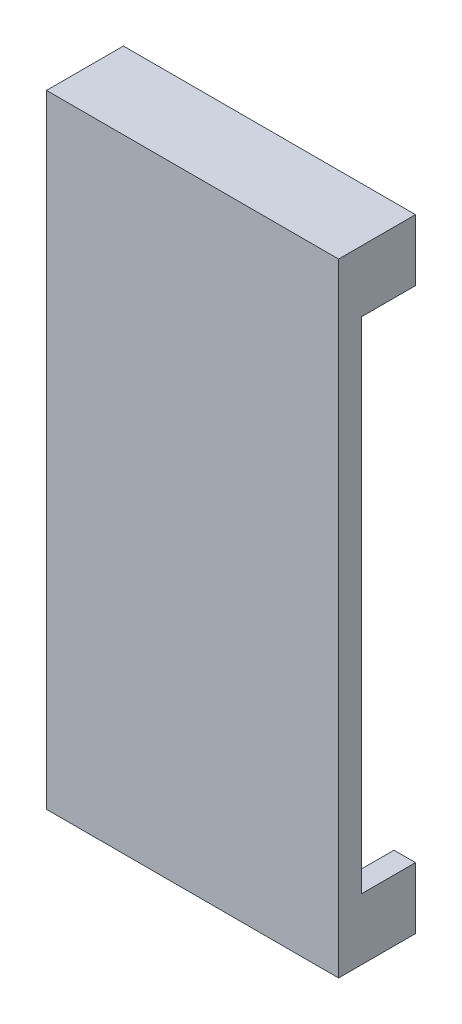
ISO-10303-21;
HEADER;
FILE_DESCRIPTION(('STEP AP214'),'2;1');
FILE_NAME('part.step','',(''),(''),'','','');
FILE_SCHEMA(('AUTOMOTIVE_DESIGN { 1 0 10303 214 1 1 1 1 }'));
ENDSEC;
DATA;
#1=APPLICATION_CONTEXT('core data for automotive mechanical design processes');
#2=APPLICATION_PROTOCOL_DEFINITION('international standard','automotive_design',2000,#1);
#3=PRODUCT_CONTEXT('',#1,'mechanical');
#4=PRODUCT('Part','Part','',(#3));
#5=PRODUCT_RELATED_PRODUCT_CATEGORY('part','',(#4));
#6=PRODUCT_DEFINITION_FORMATION('','',#4);
#7=PRODUCT_DEFINITION_CONTEXT('part definition',#1,'design');
#8=PRODUCT_DEFINITION('design','',#6,#7);
#9=PRODUCT_DEFINITION_SHAPE('','',#8);
#10=(LENGTH_UNIT() NAMED_UNIT(*) SI_UNIT(.MILLI.,.METRE.));
#11=(NAMED_UNIT(*) PLANE_ANGLE_UNIT() SI_UNIT($,.RADIAN.));
#12=(NAMED_UNIT(*) SI_UNIT($,.STERADIAN.) SOLID_ANGLE_UNIT());
#13=UNCERTAINTY_MEASURE_WITH_UNIT(LENGTH_MEASURE(1.E-05),#10,'distance_accuracy_value','');
#14=(GEOMETRIC_REPRESENTATION_CONTEXT(3) GLOBAL_UNCERTAINTY_ASSIGNED_CONTEXT((#13)) GLOBAL_UNIT_ASSIGNED_CONTEXT((#10,
#11,#12)) REPRESENTATION_CONTEXT('',''));
#15=CARTESIAN_POINT('',(0.,0.,0.));
#16=DIRECTION('',(0.,0.,1.));
#17=DIRECTION('',(1.,0.,0.));
#18=AXIS2_PLACEMENT_3D('',#15,#16,#17);
#19=CARTESIAN_POINT('',(0.,0.,0.));
#20=DIRECTION('',(0.,0.,1.));
#21=DIRECTION('',(1.,0.,0.));
#22=AXIS2_PLACEMENT_3D('',#19,#20,#21);
#23=PLANE('',#22);
#24=DIRECTION('',(1.,0.,0.));
#25=VECTOR('',#24,1.);
#26=CARTESIAN_POINT('',(19.,-70.5,0.));
#27=LINE('',#26,#25);
#28=CARTESIAN_POINT('',(16.2,-70.5,0.));
#29=VERTEX_POINT('',#28);
#30=CARTESIAN_POINT('',(19.,-70.5,0.));
#31=VERTEX_POINT('',#30);
#32=EDGE_CURVE('E286',#29,#31,#27,.T.);
#33=ORIENTED_EDGE('',*,*,#32,.F.);
#34=DIRECTION('',(0.,1.,0.));
#35=VECTOR('',#34,1.);
#36=CARTESIAN_POINT('',(16.2,-70.5,0.));
#37=LINE('',#36,#35);
#38=CARTESIAN_POINT('',(16.2,-77.1999999999999,0.));
#39=VERTEX_POINT('',#38);
#40=EDGE_CURVE('E168',#39,#29,#37,.T.);
#41=ORIENTED_EDGE('',*,*,#40,.F.);
#42=DIRECTION('',(1.,0.,0.));
#43=VECTOR('',#42,1.);
#44=CARTESIAN_POINT('',(16.2,-77.1999999999999,0.));
#45=LINE('',#44,#43);
#46=CARTESIAN_POINT('',(-16.2,-77.1999999999999,0.));
#47=VERTEX_POINT('',#46);
#48=EDGE_CURVE('E164',#47,#39,#45,.T.);
#49=ORIENTED_EDGE('',*,*,#48,.F.);
#50=DIRECTION('',(0.,-1.,0.));
#51=VECTOR('',#50,1.);
#52=CARTESIAN_POINT('',(-16.2,-70.5,0.));
#53=LINE('',#52,#51);
#54=CARTESIAN_POINT('',(-16.2,-70.5,0.));
#55=VERTEX_POINT('',#54);
#56=EDGE_CURVE('E282',#55,#47,#53,.T.);
#57=ORIENTED_EDGE('',*,*,#56,.F.);
#58=DIRECTION('',(1.,0.,0.));
#59=VECTOR('',#58,1.);
#60=CARTESIAN_POINT('',(-19.,-70.5,0.));
#61=LINE('',#60,#59);
#62=CARTESIAN_POINT('',(-19.,-70.5,0.));
#63=VERTEX_POINT('',#62);
#64=EDGE_CURVE('E280',#63,#55,#61,.T.);
#65=ORIENTED_EDGE('',*,*,#64,.F.);
#66=DIRECTION('',(0.,-1.,0.));
#67=VECTOR('',#66,1.);
#68=CARTESIAN_POINT('',(-19.,-78.5,0.));
#69=LINE('',#68,#67);
#70=CARTESIAN_POINT('',(-19.,-5.49999999999998,0.));
#71=VERTEX_POINT('',#70);
#72=EDGE_CURVE('E227',#71,#63,#69,.T.);
#73=ORIENTED_EDGE('',*,*,#72,.F.);
#74=DIRECTION('',(-1.,0.,0.));
#75=VECTOR('',#74,1.);
#76=CARTESIAN_POINT('',(-19.,-5.49999999999997,0.));
#77=LINE('',#76,#75);
#78=CARTESIAN_POINT('',(-16.2,-5.49999999999997,0.));
#79=VERTEX_POINT('',#78);
#80=EDGE_CURVE('E49',#79,#71,#77,.T.);
#81=ORIENTED_EDGE('',*,*,#80,.F.);
#82=DIRECTION('',(0.,-1.,0.));
#83=VECTOR('',#82,1.);
#84=CARTESIAN_POINT('',(-16.2,-5.49999999999997,0.));
#85=LINE('',#84,#83);
#86=CARTESIAN_POINT('',(-16.2,1.2,0.));
#87=VERTEX_POINT('',#86);
#88=EDGE_CURVE('E53',#87,#79,#85,.T.);
#89=ORIENTED_EDGE('',*,*,#88,.F.);
#90=DIRECTION('',(-1.,0.,0.));
#91=VECTOR('',#90,1.);
#92=CARTESIAN_POINT('',(16.2,1.2,0.));
#93=LINE('',#92,#91);
#94=CARTESIAN_POINT('',(16.2,1.2,0.));
#95=VERTEX_POINT('',#94);
#96=EDGE_CURVE('E201',#95,#87,#93,.T.);
#97=ORIENTED_EDGE('',*,*,#96,.F.);
#98=DIRECTION('',(0.,1.,0.));
#99=VECTOR('',#98,1.);
#100=CARTESIAN_POINT('',(16.2,-5.49999999999997,0.));
#101=LINE('',#100,#99);
#102=CARTESIAN_POINT('',(16.2,-5.49999999999997,0.));
#103=VERTEX_POINT('',#102);
#104=EDGE_CURVE('E173',#103,#95,#101,.T.);
#105=ORIENTED_EDGE('',*,*,#104,.F.);
#106=DIRECTION('',(-1.,0.,0.));
#107=VECTOR('',#106,1.);
#108=CARTESIAN_POINT('',(19.,-5.49999999999997,0.));
#109=LINE('',#108,#107);
#110=CARTESIAN_POINT('',(19.,-5.49999999999998,0.));
#111=VERTEX_POINT('',#110);
#112=EDGE_CURVE('E170',#111,#103,#109,.T.);
#113=ORIENTED_EDGE('',*,*,#112,.F.);
#114=DIRECTION('',(0.,1.,0.));
#115=VECTOR('',#114,1.);
#116=CARTESIAN_POINT('',(19.,-78.5,0.));
#117=LINE('',#116,#115);
#118=EDGE_CURVE('E222',#31,#111,#117,.T.);
#119=ORIENTED_EDGE('',*,*,#118,.F.);
#120=EDGE_LOOP('',(#33,#41,#49,#57,#65,#73,#81,#89,#97,#105,#113,#119));
#121=FACE_BOUND('',#120,.T.);
#122=ADVANCED_FACE('F34',(#121),#23,.F.);
#123=CARTESIAN_POINT('',(19.,-78.5,3.));
#124=DIRECTION('',(-1.,0.,0.));
#125=DIRECTION('',(0.,-1.,0.));
#126=AXIS2_PLACEMENT_3D('',#123,#124,#125);
#127=PLANE('',#126);
#128=DIRECTION('',(0.,0.,-1.));
#129=VECTOR('',#128,1.);
#130=CARTESIAN_POINT('',(19.,-78.5,3.));
#131=LINE('',#130,#129);
#132=CARTESIAN_POINT('',(19.,-78.5,3.));
#133=VERTEX_POINT('',#132);
#134=CARTESIAN_POINT('',(19.,-78.5,-7.));
#135=VERTEX_POINT('',#134);
#136=EDGE_CURVE('E233',#133,#135,#131,.T.);
#137=ORIENTED_EDGE('',*,*,#136,.T.);
#138=DIRECTION('',(0.,-1.,0.));
#139=VECTOR('',#138,1.);
#140=CARTESIAN_POINT('',(19.,-70.5,-7.));
#141=LINE('',#140,#139);
#142=CARTESIAN_POINT('',(19.,-70.5,-7.));
#143=VERTEX_POINT('',#142);
#144=EDGE_CURVE('E154',#143,#135,#141,.T.);
#145=ORIENTED_EDGE('',*,*,#144,.F.);
#146=DIRECTION('',(0.,0.,1.));
#147=VECTOR('',#146,1.);
#148=CARTESIAN_POINT('',(19.,-70.5,-7.));
#149=LINE('',#148,#147);
#150=EDGE_CURVE('E150',#143,#31,#149,.T.);
#151=ORIENTED_EDGE('',*,*,#150,.T.);
#152=ORIENTED_EDGE('',*,*,#118,.T.);
#153=DIRECTION('',(0.,0.,1.));
#154=VECTOR('',#153,1.);
#155=CARTESIAN_POINT('',(19.,-5.49999999999997,-7.));
#156=LINE('',#155,#154);
#157=CARTESIAN_POINT('',(19.,-5.49999999999997,-7.));
#158=VERTEX_POINT('',#157);
#159=EDGE_CURVE('E197',#158,#111,#156,.T.);
#160=ORIENTED_EDGE('',*,*,#159,.F.);
#161=DIRECTION('',(0.,-1.,0.));
#162=VECTOR('',#161,1.);
#163=CARTESIAN_POINT('',(19.,-5.49999999999997,-7.));
#164=LINE('',#163,#162);
#165=CARTESIAN_POINT('',(19.,2.50000000000003,-7.));
#166=VERTEX_POINT('',#165);
#167=EDGE_CURVE('E196',#166,#158,#164,.T.);
#168=ORIENTED_EDGE('',*,*,#167,.F.);
#169=DIRECTION('',(0.,0.,-1.));
#170=VECTOR('',#169,1.);
#171=CARTESIAN_POINT('',(19.,2.50000000000003,3.));
#172=LINE('',#171,#170);
#173=CARTESIAN_POINT('',(19.,2.50000000000003,3.));
#174=VERTEX_POINT('',#173);
#175=EDGE_CURVE('E11',#174,#166,#172,.T.);
#176=ORIENTED_EDGE('',*,*,#175,.F.);
#177=DIRECTION('',(0.,1.,0.));
#178=VECTOR('',#177,1.);
#179=CARTESIAN_POINT('',(19.,-78.5,3.));
#180=LINE('',#179,#178);
#181=EDGE_CURVE('E223',#133,#174,#180,.T.);
#182=ORIENTED_EDGE('',*,*,#181,.F.);
#183=EDGE_LOOP('',(#137,#145,#151,#152,#160,#168,#176,#182));
#184=FACE_BOUND('',#183,.T.);
#185=ADVANCED_FACE('F36',(#184),#127,.F.);
#186=CARTESIAN_POINT('',(19.,2.50000000000003,3.));
#187=DIRECTION('',(0.,-1.,0.));
#188=DIRECTION('',(1.,0.,0.));
#189=AXIS2_PLACEMENT_3D('',#186,#187,#188);
#190=PLANE('',#189);
#191=ORIENTED_EDGE('',*,*,#175,.T.);
#192=DIRECTION('',(1.,0.,0.));
#193=VECTOR('',#192,1.);
#194=CARTESIAN_POINT('',(19.,2.50000000000003,-7.));
#195=LINE('',#194,#193);
#196=CARTESIAN_POINT('',(-19.,2.50000000000002,-7.));
#197=VERTEX_POINT('',#196);
#198=EDGE_CURVE('E193',#197,#166,#195,.T.);
#199=ORIENTED_EDGE('',*,*,#198,.F.);
#200=DIRECTION('',(0.,0.,-1.));
#201=VECTOR('',#200,1.);
#202=CARTESIAN_POINT('',(-19.,2.50000000000002,3.));
#203=LINE('',#202,#201);
#204=CARTESIAN_POINT('',(-19.,2.50000000000002,3.));
#205=VERTEX_POINT('',#204);
#206=EDGE_CURVE('E42',#205,#197,#203,.T.);
#207=ORIENTED_EDGE('',*,*,#206,.F.);
#208=DIRECTION('',(-1.,0.,0.));
#209=VECTOR('',#208,1.);
#210=CARTESIAN_POINT('',(19.,2.50000000000003,3.));
#211=LINE('',#210,#209);
#212=EDGE_CURVE('E226',#174,#205,#211,.T.);
#213=ORIENTED_EDGE('',*,*,#212,.F.);
#214=EDGE_LOOP('',(#191,#199,#207,#213));
#215=FACE_BOUND('',#214,.T.);
#216=ADVANCED_FACE('F252',(#215),#190,.F.);
#217=CARTESIAN_POINT('',(-19.,-78.5,3.));
#218=DIRECTION('',(1.,0.,0.));
#219=DIRECTION('',(0.,1.,0.));
#220=AXIS2_PLACEMENT_3D('',#217,#218,#219);
#221=PLANE('',#220);
#222=ORIENTED_EDGE('',*,*,#206,.T.);
#223=DIRECTION('',(0.,1.,0.));
#224=VECTOR('',#223,1.);
#225=CARTESIAN_POINT('',(-19.,2.50000000000002,-7.));
#226=LINE('',#225,#224);
#227=CARTESIAN_POINT('',(-19.,-5.49999999999997,-7.));
#228=VERTEX_POINT('',#227);
#229=EDGE_CURVE('E190',#228,#197,#226,.T.);
#230=ORIENTED_EDGE('',*,*,#229,.F.);
#231=DIRECTION('',(0.,0.,1.));
#232=VECTOR('',#231,1.);
#233=CARTESIAN_POINT('',(-19.,-5.49999999999997,-7.));
#234=LINE('',#233,#232);
#235=EDGE_CURVE('E207',#228,#71,#234,.T.);
#236=ORIENTED_EDGE('',*,*,#235,.T.);
#237=ORIENTED_EDGE('',*,*,#72,.T.);
#238=DIRECTION('',(0.,0.,1.));
#239=VECTOR('',#238,1.);
#240=CARTESIAN_POINT('',(-19.,-70.5,-7.));
#241=LINE('',#240,#239);
#242=CARTESIAN_POINT('',(-19.,-70.5,-7.));
#243=VERTEX_POINT('',#242);
#244=EDGE_CURVE('E175',#243,#63,#241,.T.);
#245=ORIENTED_EDGE('',*,*,#244,.F.);
#246=DIRECTION('',(0.,1.,0.));
#247=VECTOR('',#246,1.);
#248=CARTESIAN_POINT('',(-19.,-78.5,-7.));
#249=LINE('',#248,#247);
#250=CARTESIAN_POINT('',(-19.,-78.5,-7.));
#251=VERTEX_POINT('',#250);
#252=EDGE_CURVE('E303',#251,#243,#249,.T.);
#253=ORIENTED_EDGE('',*,*,#252,.F.);
#254=DIRECTION('',(0.,0.,-1.));
#255=VECTOR('',#254,1.);
#256=CARTESIAN_POINT('',(-19.,-78.5,3.));
#257=LINE('',#256,#255);
#258=CARTESIAN_POINT('',(-19.,-78.5,3.));
#259=VERTEX_POINT('',#258);
#260=EDGE_CURVE('E238',#259,#251,#257,.T.);
#261=ORIENTED_EDGE('',*,*,#260,.F.);
#262=DIRECTION('',(0.,-1.,0.));
#263=VECTOR('',#262,1.);
#264=CARTESIAN_POINT('',(-19.,-78.5,3.));
#265=LINE('',#264,#263);
#266=EDGE_CURVE('E229',#205,#259,#265,.T.);
#267=ORIENTED_EDGE('',*,*,#266,.F.);
#268=EDGE_LOOP('',(#222,#230,#236,#237,#245,#253,#261,#267));
#269=FACE_BOUND('',#268,.T.);
#270=ADVANCED_FACE('F243',(#269),#221,.F.);
#271=CARTESIAN_POINT('',(19.,-78.5,3.));
#272=DIRECTION('',(0.,1.,0.));
#273=DIRECTION('',(0.,0.,1.));
#274=AXIS2_PLACEMENT_3D('',#271,#272,#273);
#275=PLANE('',#274);
#276=ORIENTED_EDGE('',*,*,#260,.T.);
#277=DIRECTION('',(-1.,0.,0.));
#278=VECTOR('',#277,1.);
#279=CARTESIAN_POINT('',(19.,-78.5,-7.));
#280=LINE('',#279,#278);
#281=EDGE_CURVE('E306',#135,#251,#280,.T.);
#282=ORIENTED_EDGE('',*,*,#281,.F.);
#283=ORIENTED_EDGE('',*,*,#136,.F.);
#284=DIRECTION('',(1.,0.,0.));
#285=VECTOR('',#284,1.);
#286=CARTESIAN_POINT('',(19.,-78.5,3.));
#287=LINE('',#286,#285);
#288=EDGE_CURVE('E231',#259,#133,#287,.T.);
#289=ORIENTED_EDGE('',*,*,#288,.F.);
#290=EDGE_LOOP('',(#276,#282,#283,#289));
#291=FACE_BOUND('',#290,.T.);
#292=ADVANCED_FACE('F315',(#291),#275,.F.);
#293=CARTESIAN_POINT('',(0.,0.,3.));
#294=DIRECTION('',(0.,0.,1.));
#295=DIRECTION('',(1.,0.,0.));
#296=AXIS2_PLACEMENT_3D('',#293,#294,#295);
#297=PLANE('',#296);
#298=ORIENTED_EDGE('',*,*,#181,.T.);
#299=ORIENTED_EDGE('',*,*,#212,.T.);
#300=ORIENTED_EDGE('',*,*,#266,.T.);
#301=ORIENTED_EDGE('',*,*,#288,.T.);
#302=EDGE_LOOP('',(#298,#299,#300,#301));
#303=FACE_BOUND('',#302,.T.);
#304=ADVANCED_FACE('F318',(#303),#297,.T.);
#305=CARTESIAN_POINT('',(19.,-5.49999999999997,-7.));
#306=DIRECTION('',(0.,1.,0.));
#307=DIRECTION('',(0.,0.,1.));
#308=AXIS2_PLACEMENT_3D('',#305,#306,#307);
#309=PLANE('',#308);
#310=ORIENTED_EDGE('',*,*,#112,.T.);
#311=DIRECTION('',(0.,0.,1.));
#312=VECTOR('',#311,1.);
#313=CARTESIAN_POINT('',(16.2,-5.49999999999997,-7.));
#314=LINE('',#313,#312);
#315=CARTESIAN_POINT('',(16.2,-5.49999999999997,-7.));
#316=VERTEX_POINT('',#315);
#317=EDGE_CURVE('E219',#316,#103,#314,.T.);
#318=ORIENTED_EDGE('',*,*,#317,.F.);
#319=DIRECTION('',(-1.,0.,0.));
#320=VECTOR('',#319,1.);
#321=CARTESIAN_POINT('',(19.,-5.49999999999997,-7.));
#322=LINE('',#321,#320);
#323=EDGE_CURVE('E179',#158,#316,#322,.T.);
#324=ORIENTED_EDGE('',*,*,#323,.F.);
#325=ORIENTED_EDGE('',*,*,#159,.T.);
#326=EDGE_LOOP('',(#310,#318,#324,#325));
#327=FACE_BOUND('',#326,.T.);
#328=ADVANCED_FACE('F261',(#327),#309,.F.);
#329=CARTESIAN_POINT('',(16.2,-5.49999999999997,-7.));
#330=DIRECTION('',(1.,0.,0.));
#331=DIRECTION('',(0.,0.,-1.));
#332=AXIS2_PLACEMENT_3D('',#329,#330,#331);
#333=PLANE('',#332);
#334=ORIENTED_EDGE('',*,*,#104,.T.);
#335=DIRECTION('',(0.,0.,1.));
#336=VECTOR('',#335,1.);
#337=CARTESIAN_POINT('',(16.2,1.2,-7.));
#338=LINE('',#337,#336);
#339=CARTESIAN_POINT('',(16.2,1.2,-7.));
#340=VERTEX_POINT('',#339);
#341=EDGE_CURVE('E216',#340,#95,#338,.T.);
#342=ORIENTED_EDGE('',*,*,#341,.F.);
#343=DIRECTION('',(0.,1.,0.));
#344=VECTOR('',#343,1.);
#345=CARTESIAN_POINT('',(16.2,-5.49999999999997,-7.));
#346=LINE('',#345,#344);
#347=EDGE_CURVE('E182',#316,#340,#346,.T.);
#348=ORIENTED_EDGE('',*,*,#347,.F.);
#349=ORIENTED_EDGE('',*,*,#317,.T.);
#350=EDGE_LOOP('',(#334,#342,#348,#349));
#351=FACE_BOUND('',#350,.T.);
#352=ADVANCED_FACE('F264',(#351),#333,.F.);
#353=CARTESIAN_POINT('',(16.2,1.2,-7.));
#354=DIRECTION('',(0.,1.,0.));
#355=DIRECTION('',(-1.,0.,0.));
#356=AXIS2_PLACEMENT_3D('',#353,#354,#355);
#357=PLANE('',#356);
#358=ORIENTED_EDGE('',*,*,#96,.T.);
#359=DIRECTION('',(0.,0.,1.));
#360=VECTOR('',#359,1.);
#361=CARTESIAN_POINT('',(-16.2,1.2,-7.));
#362=LINE('',#361,#360);
#363=CARTESIAN_POINT('',(-16.2,1.2,-7.));
#364=VERTEX_POINT('',#363);
#365=EDGE_CURVE('E213',#364,#87,#362,.T.);
#366=ORIENTED_EDGE('',*,*,#365,.F.);
#367=DIRECTION('',(-1.,0.,0.));
#368=VECTOR('',#367,1.);
#369=CARTESIAN_POINT('',(16.2,1.2,-7.));
#370=LINE('',#369,#368);
#371=EDGE_CURVE('E184',#340,#364,#370,.T.);
#372=ORIENTED_EDGE('',*,*,#371,.F.);
#373=ORIENTED_EDGE('',*,*,#341,.T.);
#374=EDGE_LOOP('',(#358,#366,#372,#373));
#375=FACE_BOUND('',#374,.T.);
#376=ADVANCED_FACE('F268',(#375),#357,.F.);
#377=CARTESIAN_POINT('',(-16.2,-5.49999999999997,-7.));
#378=DIRECTION('',(-1.,0.,0.));
#379=DIRECTION('',(0.,0.,1.));
#380=AXIS2_PLACEMENT_3D('',#377,#378,#379);
#381=PLANE('',#380);
#382=ORIENTED_EDGE('',*,*,#88,.T.);
#383=DIRECTION('',(0.,0.,1.));
#384=VECTOR('',#383,1.);
#385=CARTESIAN_POINT('',(-16.2,-5.49999999999997,-7.));
#386=LINE('',#385,#384);
#387=CARTESIAN_POINT('',(-16.2,-5.49999999999997,-7.));
#388=VERTEX_POINT('',#387);
#389=EDGE_CURVE('E210',#388,#79,#386,.T.);
#390=ORIENTED_EDGE('',*,*,#389,.F.);
#391=DIRECTION('',(0.,-1.,0.));
#392=VECTOR('',#391,1.);
#393=CARTESIAN_POINT('',(-16.2,-5.49999999999997,-7.));
#394=LINE('',#393,#392);
#395=EDGE_CURVE('E186',#364,#388,#394,.T.);
#396=ORIENTED_EDGE('',*,*,#395,.F.);
#397=ORIENTED_EDGE('',*,*,#365,.T.);
#398=EDGE_LOOP('',(#382,#390,#396,#397));
#399=FACE_BOUND('',#398,.T.);
#400=ADVANCED_FACE('F272',(#399),#381,.F.);
#401=CARTESIAN_POINT('',(-19.,-5.49999999999997,-7.));
#402=DIRECTION('',(0.,1.,0.));
#403=DIRECTION('',(-1.,0.,0.));
#404=AXIS2_PLACEMENT_3D('',#401,#402,#403);
#405=PLANE('',#404);
#406=ORIENTED_EDGE('',*,*,#80,.T.);
#407=ORIENTED_EDGE('',*,*,#235,.F.);
#408=DIRECTION('',(-1.,0.,0.));
#409=VECTOR('',#408,1.);
#410=CARTESIAN_POINT('',(-19.,-5.49999999999997,-7.));
#411=LINE('',#410,#409);
#412=EDGE_CURVE('E188',#388,#228,#411,.T.);
#413=ORIENTED_EDGE('',*,*,#412,.F.);
#414=ORIENTED_EDGE('',*,*,#389,.T.);
#415=EDGE_LOOP('',(#406,#407,#413,#414));
#416=FACE_BOUND('',#415,.T.);
#417=ADVANCED_FACE('F274',(#416),#405,.F.);
#418=CARTESIAN_POINT('',(0.,0.,-7.));
#419=DIRECTION('',(0.,0.,-1.));
#420=DIRECTION('',(-1.,0.,0.));
#421=AXIS2_PLACEMENT_3D('',#418,#419,#420);
#422=PLANE('',#421);
#423=ORIENTED_EDGE('',*,*,#323,.T.);
#424=ORIENTED_EDGE('',*,*,#347,.T.);
#425=ORIENTED_EDGE('',*,*,#371,.T.);
#426=ORIENTED_EDGE('',*,*,#395,.T.);
#427=ORIENTED_EDGE('',*,*,#412,.T.);
#428=ORIENTED_EDGE('',*,*,#229,.T.);
#429=ORIENTED_EDGE('',*,*,#198,.T.);
#430=ORIENTED_EDGE('',*,*,#167,.T.);
#431=EDGE_LOOP('',(#423,#424,#425,#426,#427,#428,#429,#430));
#432=FACE_BOUND('',#431,.T.);
#433=ADVANCED_FACE('F248',(#432),#422,.T.);
#434=CARTESIAN_POINT('',(16.2,-70.5,-7.));
#435=DIRECTION('',(1.,0.,0.));
#436=DIRECTION('',(0.,0.,-1.));
#437=AXIS2_PLACEMENT_3D('',#434,#435,#436);
#438=PLANE('',#437);
#439=ORIENTED_EDGE('',*,*,#40,.T.);
#440=DIRECTION('',(0.,0.,1.));
#441=VECTOR('',#440,1.);
#442=CARTESIAN_POINT('',(16.2,-70.5,-7.));
#443=LINE('',#442,#441);
#444=CARTESIAN_POINT('',(16.2,-70.5,-7.));
#445=VERTEX_POINT('',#444);
#446=EDGE_CURVE('E147',#445,#29,#443,.T.);
#447=ORIENTED_EDGE('',*,*,#446,.F.);
#448=DIRECTION('',(0.,1.,0.));
#449=VECTOR('',#448,1.);
#450=CARTESIAN_POINT('',(16.2,-70.5,-7.));
#451=LINE('',#450,#449);
#452=CARTESIAN_POINT('',(16.2,-77.1999999999999,-7.));
#453=VERTEX_POINT('',#452);
#454=EDGE_CURVE('E155',#453,#445,#451,.T.);
#455=ORIENTED_EDGE('',*,*,#454,.F.);
#456=DIRECTION('',(0.,0.,1.));
#457=VECTOR('',#456,1.);
#458=CARTESIAN_POINT('',(16.2,-77.1999999999999,-7.));
#459=LINE('',#458,#457);
#460=EDGE_CURVE('E293',#453,#39,#459,.T.);
#461=ORIENTED_EDGE('',*,*,#460,.T.);
#462=EDGE_LOOP('',(#439,#447,#455,#461));
#463=FACE_BOUND('',#462,.T.);
#464=ADVANCED_FACE('F166',(#463),#438,.F.);
#465=CARTESIAN_POINT('',(19.,-70.5,-7.));
#466=DIRECTION('',(0.,-1.,0.));
#467=DIRECTION('',(0.,0.,-1.));
#468=AXIS2_PLACEMENT_3D('',#465,#466,#467);
#469=PLANE('',#468);
#470=ORIENTED_EDGE('',*,*,#32,.T.);
#471=ORIENTED_EDGE('',*,*,#150,.F.);
#472=DIRECTION('',(1.,0.,0.));
#473=VECTOR('',#472,1.);
#474=CARTESIAN_POINT('',(19.,-70.5,-7.));
#475=LINE('',#474,#473);
#476=EDGE_CURVE('E143',#445,#143,#475,.T.);
#477=ORIENTED_EDGE('',*,*,#476,.F.);
#478=ORIENTED_EDGE('',*,*,#446,.T.);
#479=EDGE_LOOP('',(#470,#471,#477,#478));
#480=FACE_BOUND('',#479,.T.);
#481=ADVANCED_FACE('F145',(#480),#469,.F.);
#482=CARTESIAN_POINT('',(-19.,-70.5,-7.));
#483=DIRECTION('',(0.,-1.,0.));
#484=DIRECTION('',(0.,0.,-1.));
#485=AXIS2_PLACEMENT_3D('',#482,#483,#484);
#486=PLANE('',#485);
#487=ORIENTED_EDGE('',*,*,#64,.T.);
#488=DIRECTION('',(0.,0.,1.));
#489=VECTOR('',#488,1.);
#490=CARTESIAN_POINT('',(-16.2,-70.5,-7.));
#491=LINE('',#490,#489);
#492=CARTESIAN_POINT('',(-16.2,-70.5,-7.));
#493=VERTEX_POINT('',#492);
#494=EDGE_CURVE('E298',#493,#55,#491,.T.);
#495=ORIENTED_EDGE('',*,*,#494,.F.);
#496=DIRECTION('',(1.,0.,0.));
#497=VECTOR('',#496,1.);
#498=CARTESIAN_POINT('',(-19.,-70.5,-7.));
#499=LINE('',#498,#497);
#500=EDGE_CURVE('E300',#243,#493,#499,.T.);
#501=ORIENTED_EDGE('',*,*,#500,.F.);
#502=ORIENTED_EDGE('',*,*,#244,.T.);
#503=EDGE_LOOP('',(#487,#495,#501,#502));
#504=FACE_BOUND('',#503,.T.);
#505=ADVANCED_FACE('F299',(#504),#486,.F.);
#506=CARTESIAN_POINT('',(-16.2,-70.5,-7.));
#507=DIRECTION('',(-1.,0.,0.));
#508=DIRECTION('',(0.,0.,1.));
#509=AXIS2_PLACEMENT_3D('',#506,#507,#508);
#510=PLANE('',#509);
#511=ORIENTED_EDGE('',*,*,#56,.T.);
#512=DIRECTION('',(0.,0.,1.));
#513=VECTOR('',#512,1.);
#514=CARTESIAN_POINT('',(-16.2,-77.1999999999999,-7.));
#515=LINE('',#514,#513);
#516=CARTESIAN_POINT('',(-16.2,-77.1999999999999,-7.));
#517=VERTEX_POINT('',#516);
#518=EDGE_CURVE('E295',#517,#47,#515,.T.);
#519=ORIENTED_EDGE('',*,*,#518,.F.);
#520=DIRECTION('',(0.,-1.,0.));
#521=VECTOR('',#520,1.);
#522=CARTESIAN_POINT('',(-16.2,-70.5,-7.));
#523=LINE('',#522,#521);
#524=EDGE_CURVE('E302',#493,#517,#523,.T.);
#525=ORIENTED_EDGE('',*,*,#524,.F.);
#526=ORIENTED_EDGE('',*,*,#494,.T.);
#527=EDGE_LOOP('',(#511,#519,#525,#526));
#528=FACE_BOUND('',#527,.T.);
#529=ADVANCED_FACE('F418',(#528),#510,.F.);
#530=CARTESIAN_POINT('',(16.2,-77.1999999999999,-7.));
#531=DIRECTION('',(0.,-1.,0.));
#532=DIRECTION('',(1.,0.,0.));
#533=AXIS2_PLACEMENT_3D('',#530,#531,#532);
#534=PLANE('',#533);
#535=ORIENTED_EDGE('',*,*,#48,.T.);
#536=ORIENTED_EDGE('',*,*,#460,.F.);
#537=DIRECTION('',(1.,0.,0.));
#538=VECTOR('',#537,1.);
#539=CARTESIAN_POINT('',(16.2,-77.1999999999999,-7.));
#540=LINE('',#539,#538);
#541=EDGE_CURVE('E160',#517,#453,#540,.T.);
#542=ORIENTED_EDGE('',*,*,#541,.F.);
#543=ORIENTED_EDGE('',*,*,#518,.T.);
#544=EDGE_LOOP('',(#535,#536,#542,#543));
#545=FACE_BOUND('',#544,.T.);
#546=ADVANCED_FACE('F427',(#545),#534,.F.);
#547=CARTESIAN_POINT('',(0.,0.,-7.));
#548=DIRECTION('',(0.,0.,-1.));
#549=DIRECTION('',(-1.,0.,0.));
#550=AXIS2_PLACEMENT_3D('',#547,#548,#549);
#551=PLANE('',#550);
#552=ORIENTED_EDGE('',*,*,#454,.T.);
#553=ORIENTED_EDGE('',*,*,#476,.T.);
#554=ORIENTED_EDGE('',*,*,#144,.T.);
#555=ORIENTED_EDGE('',*,*,#281,.T.);
#556=ORIENTED_EDGE('',*,*,#252,.T.);
#557=ORIENTED_EDGE('',*,*,#500,.T.);
#558=ORIENTED_EDGE('',*,*,#524,.T.);
#559=ORIENTED_EDGE('',*,*,#541,.T.);
#560=EDGE_LOOP('',(#552,#553,#554,#555,#556,#557,#558,#559));
#561=FACE_BOUND('',#560,.T.);
#562=ADVANCED_FACE('F158',(#561),#551,.T.);
#563=CLOSED_SHELL('',(#122,#185,#216,#270,#292,#304,#328,#352,#376,#400,#417,#433,#464,#481,
#505,#529,#546,#562));
#564=MANIFOLD_SOLID_BREP('B2',#563);
#565=ADVANCED_BREP_SHAPE_REPRESENTATION('',(#18,#564),#14);
#566=SHAPE_DEFINITION_REPRESENTATION(#9,#565);
ENDSEC;
END-ISO-10303-21;
